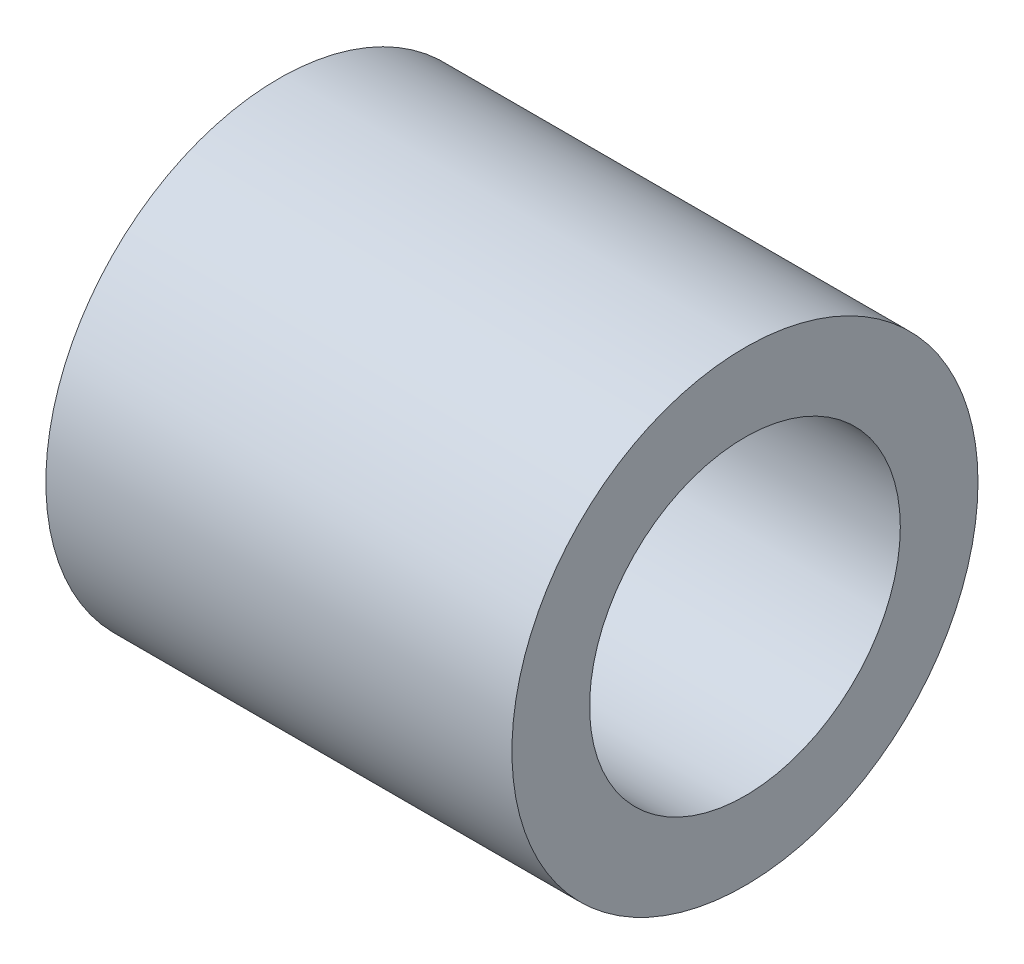
ISO-10303-21;
HEADER;
FILE_DESCRIPTION(('STEP AP214'),'2;1');
FILE_NAME('part.step','',(''),(''),'','','');
FILE_SCHEMA(('AUTOMOTIVE_DESIGN { 1 0 10303 214 1 1 1 1 }'));
ENDSEC;
DATA;
#1=APPLICATION_CONTEXT('core data for automotive mechanical design processes');
#2=APPLICATION_PROTOCOL_DEFINITION('international standard','automotive_design',2000,#1);
#3=PRODUCT_CONTEXT('',#1,'mechanical');
#4=PRODUCT('Part','Part','',(#3));
#5=PRODUCT_RELATED_PRODUCT_CATEGORY('part','',(#4));
#6=PRODUCT_DEFINITION_FORMATION('','',#4);
#7=PRODUCT_DEFINITION_CONTEXT('part definition',#1,'design');
#8=PRODUCT_DEFINITION('design','',#6,#7);
#9=PRODUCT_DEFINITION_SHAPE('','',#8);
#10=(LENGTH_UNIT() NAMED_UNIT(*) SI_UNIT(.MILLI.,.METRE.));
#11=(NAMED_UNIT(*) PLANE_ANGLE_UNIT() SI_UNIT($,.RADIAN.));
#12=(NAMED_UNIT(*) SI_UNIT($,.STERADIAN.) SOLID_ANGLE_UNIT());
#13=UNCERTAINTY_MEASURE_WITH_UNIT(LENGTH_MEASURE(1.E-05),#10,'distance_accuracy_value','');
#14=(GEOMETRIC_REPRESENTATION_CONTEXT(3) GLOBAL_UNCERTAINTY_ASSIGNED_CONTEXT((#13)) GLOBAL_UNIT_ASSIGNED_CONTEXT((#10,
#11,#12)) REPRESENTATION_CONTEXT('',''));
#15=CARTESIAN_POINT('',(0.,0.,0.));
#16=DIRECTION('',(0.,0.,1.));
#17=DIRECTION('',(1.,0.,0.));
#18=AXIS2_PLACEMENT_3D('',#15,#16,#17);
#19=CARTESIAN_POINT('',(-18.,0.,0.));
#20=DIRECTION('',(1.,0.,0.));
#21=DIRECTION('',(0.,0.,-1.));
#22=AXIS2_PLACEMENT_3D('',#19,#20,#21);
#23=CYLINDRICAL_SURFACE('',#22,9.);
#24=CARTESIAN_POINT('',(-18.,0.,0.));
#25=DIRECTION('',(1.,0.,0.));
#26=DIRECTION('',(0.,0.,-1.));
#27=AXIS2_PLACEMENT_3D('',#24,#25,#26);
#28=CIRCLE('',#27,9.);
#29=CARTESIAN_POINT('',(-18.,0.,-9.));
#30=VERTEX_POINT('',#29);
#31=EDGE_CURVE('E10',#30,#30,#28,.T.);
#32=ORIENTED_EDGE('',*,*,#31,.T.);
#33=EDGE_LOOP('',(#32));
#34=FACE_BOUND('',#33,.T.);
#35=CARTESIAN_POINT('',(0.,0.,0.));
#36=DIRECTION('',(1.,0.,0.));
#37=DIRECTION('',(0.,0.,-1.));
#38=AXIS2_PLACEMENT_3D('',#35,#36,#37);
#39=CIRCLE('',#38,9.);
#40=CARTESIAN_POINT('',(0.,0.,-9.));
#41=VERTEX_POINT('',#40);
#42=EDGE_CURVE('E38',#41,#41,#39,.T.);
#43=ORIENTED_EDGE('',*,*,#42,.F.);
#44=EDGE_LOOP('',(#43));
#45=FACE_BOUND('',#44,.T.);
#46=ADVANCED_FACE('F35',(#34,#45),#23,.T.);
#47=CARTESIAN_POINT('',(-18.,0.,0.));
#48=DIRECTION('',(1.,0.,0.));
#49=DIRECTION('',(0.,0.,-1.));
#50=AXIS2_PLACEMENT_3D('',#47,#48,#49);
#51=PLANE('',#50);
#52=CARTESIAN_POINT('',(-18.,0.,0.));
#53=DIRECTION('',(1.,0.,0.));
#54=DIRECTION('',(0.,0.,-1.));
#55=AXIS2_PLACEMENT_3D('',#52,#53,#54);
#56=CIRCLE('',#55,6.);
#57=CARTESIAN_POINT('',(-18.,0.,-6.));
#58=VERTEX_POINT('',#57);
#59=EDGE_CURVE('E45',#58,#58,#56,.T.);
#60=ORIENTED_EDGE('',*,*,#59,.T.);
#61=EDGE_LOOP('',(#60));
#62=FACE_BOUND('',#61,.T.);
#63=ORIENTED_EDGE('',*,*,#31,.F.);
#64=EDGE_LOOP('',(#63));
#65=FACE_BOUND('',#64,.T.);
#66=ADVANCED_FACE('F53',(#62,#65),#51,.F.);
#67=CARTESIAN_POINT('',(0.,0.,0.));
#68=DIRECTION('',(1.,0.,0.));
#69=DIRECTION('',(0.,0.,-1.));
#70=AXIS2_PLACEMENT_3D('',#67,#68,#69);
#71=PLANE('',#70);
#72=CARTESIAN_POINT('',(0.,0.,0.));
#73=DIRECTION('',(1.,0.,0.));
#74=DIRECTION('',(0.,0.,-1.));
#75=AXIS2_PLACEMENT_3D('',#72,#73,#74);
#76=CIRCLE('',#75,6.);
#77=CARTESIAN_POINT('',(0.,0.,-6.));
#78=VERTEX_POINT('',#77);
#79=EDGE_CURVE('E47',#78,#78,#76,.T.);
#80=ORIENTED_EDGE('',*,*,#79,.F.);
#81=EDGE_LOOP('',(#80));
#82=FACE_BOUND('',#81,.T.);
#83=ORIENTED_EDGE('',*,*,#42,.T.);
#84=EDGE_LOOP('',(#83));
#85=FACE_BOUND('',#84,.T.);
#86=ADVANCED_FACE('F59',(#82,#85),#71,.T.);
#87=CARTESIAN_POINT('',(-18.,0.,0.));
#88=DIRECTION('',(1.,0.,0.));
#89=DIRECTION('',(0.,0.,-1.));
#90=AXIS2_PLACEMENT_3D('',#87,#88,#89);
#91=CYLINDRICAL_SURFACE('',#90,6.);
#92=ORIENTED_EDGE('',*,*,#59,.F.);
#93=EDGE_LOOP('',(#92));
#94=FACE_BOUND('',#93,.T.);
#95=ORIENTED_EDGE('',*,*,#79,.T.);
#96=EDGE_LOOP('',(#95));
#97=FACE_BOUND('',#96,.T.);
#98=ADVANCED_FACE('F56',(#94,#97),#91,.F.);
#99=CLOSED_SHELL('',(#46,#66,#86,#98));
#100=MANIFOLD_SOLID_BREP('B2',#99);
#101=ADVANCED_BREP_SHAPE_REPRESENTATION('',(#18,#100),#14);
#102=SHAPE_DEFINITION_REPRESENTATION(#9,#101);
ENDSEC;
END-ISO-10303-21;
